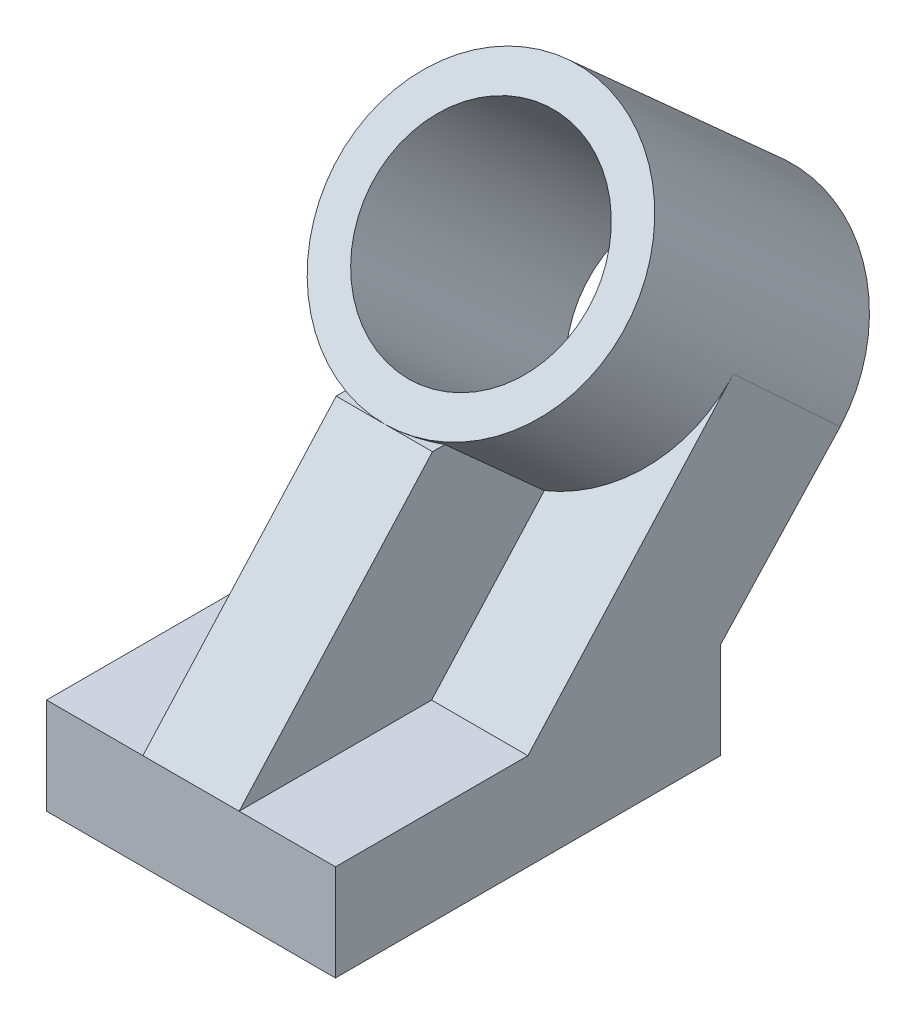
ISO-10303-21;
HEADER;
FILE_DESCRIPTION(('STEP AP214'),'2;1');
FILE_NAME('part.step','',(''),(''),'','','');
FILE_SCHEMA(('AUTOMOTIVE_DESIGN { 1 0 10303 214 1 1 1 1 }'));
ENDSEC;
DATA;
#1=APPLICATION_CONTEXT('core data for automotive mechanical design processes');
#2=APPLICATION_PROTOCOL_DEFINITION('international standard','automotive_design',2000,#1);
#3=PRODUCT_CONTEXT('',#1,'mechanical');
#4=PRODUCT('Part','Part','',(#3));
#5=PRODUCT_RELATED_PRODUCT_CATEGORY('part','',(#4));
#6=PRODUCT_DEFINITION_FORMATION('','',#4);
#7=PRODUCT_DEFINITION_CONTEXT('part definition',#1,'design');
#8=PRODUCT_DEFINITION('design','',#6,#7);
#9=PRODUCT_DEFINITION_SHAPE('','',#8);
#10=(LENGTH_UNIT() NAMED_UNIT(*) SI_UNIT(.MILLI.,.METRE.));
#11=(NAMED_UNIT(*) PLANE_ANGLE_UNIT() SI_UNIT($,.RADIAN.));
#12=(NAMED_UNIT(*) SI_UNIT($,.STERADIAN.) SOLID_ANGLE_UNIT());
#13=UNCERTAINTY_MEASURE_WITH_UNIT(LENGTH_MEASURE(1.E-05),#10,'distance_accuracy_value','');
#14=(GEOMETRIC_REPRESENTATION_CONTEXT(3) GLOBAL_UNCERTAINTY_ASSIGNED_CONTEXT((#13)) GLOBAL_UNIT_ASSIGNED_CONTEXT((#10,
#11,#12)) REPRESENTATION_CONTEXT('',''));
#15=CARTESIAN_POINT('',(0.,0.,0.));
#16=DIRECTION('',(0.,0.,1.));
#17=DIRECTION('',(1.,0.,0.));
#18=AXIS2_PLACEMENT_3D('',#15,#16,#17);
#19=CARTESIAN_POINT('',(0.,0.,0.));
#20=DIRECTION('',(0.,1.,0.));
#21=DIRECTION('',(0.,0.,1.));
#22=AXIS2_PLACEMENT_3D('',#19,#20,#21);
#23=PLANE('',#22);
#24=DIRECTION('',(1.,0.,0.));
#25=VECTOR('',#24,1.);
#26=CARTESIAN_POINT('',(-38.1000000000003,0.,0.));
#27=LINE('',#26,#25);
#28=CARTESIAN_POINT('',(-38.1000000000003,0.,0.));
#29=VERTEX_POINT('',#28);
#30=CARTESIAN_POINT('',(-12.7,0.,0.));
#31=VERTEX_POINT('',#30);
#32=EDGE_CURVE('E61',#29,#31,#27,.T.);
#33=ORIENTED_EDGE('',*,*,#32,.F.);
#34=DIRECTION('',(0.,0.,1.));
#35=VECTOR('',#34,1.);
#36=CARTESIAN_POINT('',(-38.1000000000003,0.,-50.8428477851647));
#37=LINE('',#36,#35);
#38=CARTESIAN_POINT('',(-38.1000000000003,0.,50.7571522148353));
#39=VERTEX_POINT('',#38);
#40=EDGE_CURVE('E269',#29,#39,#37,.T.);
#41=ORIENTED_EDGE('',*,*,#40,.T.);
#42=DIRECTION('',(1.,0.,0.));
#43=VECTOR('',#42,1.);
#44=CARTESIAN_POINT('',(-38.1000000000003,0.,50.7571522148353));
#45=LINE('',#44,#43);
#46=CARTESIAN_POINT('',(-12.7,0.,50.7571522148353));
#47=VERTEX_POINT('',#46);
#48=EDGE_CURVE('E272',#39,#47,#45,.T.);
#49=ORIENTED_EDGE('',*,*,#48,.T.);
#50=DIRECTION('',(0.,0.,-1.));
#51=VECTOR('',#50,1.);
#52=CARTESIAN_POINT('',(-12.7,0.,50.7571522148353));
#53=LINE('',#52,#51);
#54=EDGE_CURVE('E238',#47,#31,#53,.T.);
#55=ORIENTED_EDGE('',*,*,#54,.T.);
#56=EDGE_LOOP('',(#33,#41,#49,#55));
#57=FACE_BOUND('',#56,.T.);
#58=ADVANCED_FACE('F35',(#57),#23,.T.);
#59=CARTESIAN_POINT('',(0.,33.9537013475214,-82.3521117933596));
#60=DIRECTION('',(0.,0.669130606358857,0.743144825477395));
#61=DIRECTION('',(0.,-0.743144825477395,0.669130606358857));
#62=AXIS2_PLACEMENT_3D('',#59,#60,#61);
#63=CYLINDRICAL_SURFACE('',#62,38.1);
#64=CARTESIAN_POINT('',(0.,33.9537013475212,-82.3521117933597));
#65=DIRECTION('',(0.,0.732999845893333,-0.68022880409488));
#66=DIRECTION('',(0.,0.68022880409488,0.732999845893333));
#67=AXIS2_PLACEMENT_3D('',#64,#65,#66);
#68=ELLIPSE('',#67,2533.93804982842,38.1);
#69=CARTESIAN_POINT('',(38.0999999999997,33.9537013475214,-82.3521117933596));
#70=VERTEX_POINT('',#69);
#71=CARTESIAN_POINT('',(38.0956234491738,60.0787457357757,-54.2003290472178));
#72=VERTEX_POINT('',#71);
#73=EDGE_CURVE('E209',#70,#72,#68,.F.);
#74=ORIENTED_EDGE('',*,*,#73,.F.);
#75=CARTESIAN_POINT('',(0.,33.9537013475214,-82.3521117933596));
#76=DIRECTION('',(0.,0.669130606358857,0.743144825477395));
#77=DIRECTION('',(0.,-0.743144825477395,0.669130606358857));
#78=AXIS2_PLACEMENT_3D('',#75,#76,#77);
#79=CIRCLE('',#78,38.1);
#80=CARTESIAN_POINT('',(-38.1000000000003,33.9537013475214,-82.3521117933596));
#81=VERTEX_POINT('',#80);
#82=EDGE_CURVE('E212',#70,#81,#79,.T.);
#83=ORIENTED_EDGE('',*,*,#82,.T.);
#84=CARTESIAN_POINT('',(-38.0956234491738,60.0787457357757,-54.2003290472178));
#85=VERTEX_POINT('',#84);
#86=EDGE_CURVE('E178',#85,#81,#68,.F.);
#87=ORIENTED_EDGE('',*,*,#86,.F.);
#88=CARTESIAN_POINT('',(0.,59.6554109242284,-53.8074714849633));
#89=DIRECTION('',(0.,0.680228804094879,0.732999845893333));
#90=DIRECTION('',(0.,-0.732999845893333,0.680228804094879));
#91=AXIS2_PLACEMENT_3D('',#88,#89,#90);
#92=ELLIPSE('',#91,38.1043075129455,38.1);
#93=CARTESIAN_POINT('',(-38.1,59.6554109242284,-53.8074714849633));
#94=VERTEX_POINT('',#93);
#95=EDGE_CURVE('E159',#94,#85,#92,.F.);
#96=ORIENTED_EDGE('',*,*,#95,.F.);
#97=CARTESIAN_POINT('',(-37.8187786616942,56.2681260500793,-50.6640482605519));
#98=VERTEX_POINT('',#97);
#99=EDGE_CURVE('E45',#98,#94,#92,.F.);
#100=ORIENTED_EDGE('',*,*,#99,.F.);
#101=CARTESIAN_POINT('',(0.,59.7019039399693,-53.7558357598293));
#102=DIRECTION('',(0.,0.669130606358857,0.743144825477395));
#103=DIRECTION('',(0.,-0.743144825477395,0.669130606358857));
#104=AXIS2_PLACEMENT_3D('',#101,#102,#103);
#105=CIRCLE('',#104,38.1);
#106=CARTESIAN_POINT('',(-12.7,33.0073804686323,-29.719978865634));
#107=VERTEX_POINT('',#106);
#108=EDGE_CURVE('E44',#107,#98,#105,.F.);
#109=ORIENTED_EDGE('',*,*,#108,.F.);
#110=DIRECTION('',(0.,0.669130606358857,0.743144825477395));
#111=VECTOR('',#110,1.);
#112=CARTESIAN_POINT('',(-12.7,7.25917787618441,-58.3162548991642));
#113=LINE('',#112,#111);
#114=CARTESIAN_POINT('',(-12.7,56.6276357013775,-3.48702780068732));
#115=VERTEX_POINT('',#114);
#116=EDGE_CURVE('E278',#115,#107,#113,.F.);
#117=ORIENTED_EDGE('',*,*,#116,.F.);
#118=CARTESIAN_POINT('',(0.,56.6276357013775,-57.1701565395513));
#119=DIRECTION('',(0.,-1.,0.));
#120=DIRECTION('',(0.,0.,1.));
#121=AXIS2_PLACEMENT_3D('',#118,#119,#120);
#122=ELLIPSE('',#121,56.9395565498417,38.1);
#123=CARTESIAN_POINT('',(0.,56.6276357013775,-0.230599989709569));
#124=VERTEX_POINT('',#123);
#125=EDGE_CURVE('E215',#124,#115,#122,.T.);
#126=ORIENTED_EDGE('',*,*,#125,.F.);
#127=CARTESIAN_POINT('',(0.,84.9414535520663,-25.724476091982));
#128=DIRECTION('',(0.,0.669130606358857,0.743144825477395));
#129=DIRECTION('',(0.,-0.743144825477395,0.669130606358857));
#130=AXIS2_PLACEMENT_3D('',#127,#128,#129);
#131=CIRCLE('',#130,38.1);
#132=EDGE_CURVE('E217',#124,#124,#131,.T.);
#133=ORIENTED_EDGE('',*,*,#132,.F.);
#134=CARTESIAN_POINT('',(12.7,56.6276357013775,-3.48702780068732));
#135=VERTEX_POINT('',#134);
#136=EDGE_CURVE('E223',#135,#124,#122,.T.);
#137=ORIENTED_EDGE('',*,*,#136,.F.);
#138=DIRECTION('',(0.,0.669130606358857,0.743144825477395));
#139=VECTOR('',#138,1.);
#140=CARTESIAN_POINT('',(12.7,7.25917787618441,-58.3162548991642));
#141=LINE('',#140,#139);
#142=CARTESIAN_POINT('',(12.7,33.0073804686323,-29.719978865634));
#143=VERTEX_POINT('',#142);
#144=EDGE_CURVE('E222',#135,#143,#141,.F.);
#145=ORIENTED_EDGE('',*,*,#144,.T.);
#146=CARTESIAN_POINT('',(37.8187786616942,56.2681260500793,-50.6640482605519));
#147=VERTEX_POINT('',#146);
#148=EDGE_CURVE('E39',#147,#143,#105,.F.);
#149=ORIENTED_EDGE('',*,*,#148,.F.);
#150=CARTESIAN_POINT('',(38.0999999999998,59.6554109242284,-53.8074714849633));
#151=VERTEX_POINT('',#150);
#152=EDGE_CURVE('E46',#151,#147,#92,.F.);
#153=ORIENTED_EDGE('',*,*,#152,.F.);
#154=EDGE_CURVE('E11',#72,#151,#92,.F.);
#155=ORIENTED_EDGE('',*,*,#154,.F.);
#156=EDGE_LOOP('',(#74,#83,#87,#96,#100,#109,#117,#126,#133,#137,#145,#149,#153,#155));
#157=FACE_BOUND('',#156,.T.);
#158=ADVANCED_FACE('F316',(#157),#63,.T.);
#159=CARTESIAN_POINT('',(12.7,56.6276357013775,-0.230599989709555));
#160=DIRECTION('',(0.,-1.,0.));
#161=DIRECTION('',(0.,0.,-1.));
#162=AXIS2_PLACEMENT_3D('',#159,#160,#161);
#163=PLANE('',#162);
#164=DIRECTION('',(-1.,0.,0.));
#165=VECTOR('',#164,1.);
#166=CARTESIAN_POINT('',(12.7,56.6276357013775,-0.230599989709555));
#167=LINE('',#166,#165);
#168=CARTESIAN_POINT('',(-12.7,56.6276357013775,-0.230599989709555));
#169=VERTEX_POINT('',#168);
#170=EDGE_CURVE('E249',#124,#169,#167,.T.);
#171=ORIENTED_EDGE('',*,*,#170,.F.);
#172=ORIENTED_EDGE('',*,*,#125,.T.);
#173=DIRECTION('',(0.,0.,1.));
#174=VECTOR('',#173,1.);
#175=CARTESIAN_POINT('',(-12.7,56.6276357013775,-0.230599989709555));
#176=LINE('',#175,#174);
#177=EDGE_CURVE('E243',#115,#169,#176,.T.);
#178=ORIENTED_EDGE('',*,*,#177,.T.);
#179=EDGE_LOOP('',(#171,#172,#178));
#180=FACE_BOUND('',#179,.T.);
#181=ADVANCED_FACE('F322',(#180),#163,.F.);
#182=CARTESIAN_POINT('',(12.7,0.,0.));
#183=VERTEX_POINT('',#182);
#184=CARTESIAN_POINT('',(38.0999999999997,0.,0.));
#185=VERTEX_POINT('',#184);
#186=EDGE_CURVE('E203',#183,#185,#27,.T.);
#187=ORIENTED_EDGE('',*,*,#186,.F.);
#188=DIRECTION('',(0.,0.,-1.));
#189=VECTOR('',#188,1.);
#190=CARTESIAN_POINT('',(12.7,0.,50.7571522148353));
#191=LINE('',#190,#189);
#192=CARTESIAN_POINT('',(12.7,0.,50.7571522148353));
#193=VERTEX_POINT('',#192);
#194=EDGE_CURVE('E225',#193,#183,#191,.T.);
#195=ORIENTED_EDGE('',*,*,#194,.F.);
#196=CARTESIAN_POINT('',(38.0999999999997,0.,50.7571522148353));
#197=VERTEX_POINT('',#196);
#198=EDGE_CURVE('E271',#193,#197,#45,.T.);
#199=ORIENTED_EDGE('',*,*,#198,.T.);
#200=DIRECTION('',(0.,0.,-1.));
#201=VECTOR('',#200,1.);
#202=CARTESIAN_POINT('',(38.0999999999997,0.,50.7571522148353));
#203=LINE('',#202,#201);
#204=EDGE_CURVE('E53',#197,#185,#203,.T.);
#205=ORIENTED_EDGE('',*,*,#204,.T.);
#206=EDGE_LOOP('',(#187,#195,#199,#205));
#207=FACE_BOUND('',#206,.T.);
#208=ADVANCED_FACE('F318',(#207),#23,.T.);
#209=CARTESIAN_POINT('',(38.0999999999997,-25.4,-50.8428477851647));
#210=DIRECTION('',(0.,0.,-1.));
#211=DIRECTION('',(-1.,0.,0.));
#212=AXIS2_PLACEMENT_3D('',#209,#210,#211);
#213=PLANE('',#212);
#214=DIRECTION('',(-1.,0.,0.));
#215=VECTOR('',#214,1.);
#216=CARTESIAN_POINT('',(38.0999999999997,0.,-50.8428477851647));
#217=LINE('',#216,#215);
#218=CARTESIAN_POINT('',(38.0999999999997,0.,-50.8428477851647));
#219=VERTEX_POINT('',#218);
#220=CARTESIAN_POINT('',(-38.1000000000003,0.,-50.8428477851647));
#221=VERTEX_POINT('',#220);
#222=EDGE_CURVE('E253',#219,#221,#217,.T.);
#223=ORIENTED_EDGE('',*,*,#222,.F.);
#224=DIRECTION('',(0.,1.,0.));
#225=VECTOR('',#224,1.);
#226=CARTESIAN_POINT('',(38.0999999999997,-25.4,-50.8428477851647));
#227=LINE('',#226,#225);
#228=CARTESIAN_POINT('',(38.0999999999997,-25.4,-50.8428477851647));
#229=VERTEX_POINT('',#228);
#230=EDGE_CURVE('E276',#229,#219,#227,.T.);
#231=ORIENTED_EDGE('',*,*,#230,.F.);
#232=DIRECTION('',(-1.,0.,0.));
#233=VECTOR('',#232,1.);
#234=CARTESIAN_POINT('',(38.0999999999997,-25.4,-50.8428477851647));
#235=LINE('',#234,#233);
#236=CARTESIAN_POINT('',(-38.1000000000003,-25.4,-50.8428477851647));
#237=VERTEX_POINT('',#236);
#238=EDGE_CURVE('E254',#229,#237,#235,.T.);
#239=ORIENTED_EDGE('',*,*,#238,.T.);
#240=DIRECTION('',(0.,1.,0.));
#241=VECTOR('',#240,1.);
#242=CARTESIAN_POINT('',(-38.1000000000003,-25.4,-50.8428477851647));
#243=LINE('',#242,#241);
#244=EDGE_CURVE('E266',#237,#221,#243,.T.);
#245=ORIENTED_EDGE('',*,*,#244,.T.);
#246=EDGE_LOOP('',(#223,#231,#239,#245));
#247=FACE_BOUND('',#246,.T.);
#248=ADVANCED_FACE('F37',(#247),#213,.T.);
#249=CARTESIAN_POINT('',(38.0999999999997,-25.4,50.7571522148353));
#250=DIRECTION('',(1.,0.,0.));
#251=DIRECTION('',(0.,0.,-1.));
#252=AXIS2_PLACEMENT_3D('',#249,#250,#251);
#253=PLANE('',#252);
#254=ORIENTED_EDGE('',*,*,#204,.F.);
#255=DIRECTION('',(0.,1.,0.));
#256=VECTOR('',#255,1.);
#257=CARTESIAN_POINT('',(38.0999999999997,-25.4,50.7571522148353));
#258=LINE('',#257,#256);
#259=CARTESIAN_POINT('',(38.0999999999997,-25.4,50.7571522148353));
#260=VERTEX_POINT('',#259);
#261=EDGE_CURVE('E279',#260,#197,#258,.T.);
#262=ORIENTED_EDGE('',*,*,#261,.F.);
#263=DIRECTION('',(0.,0.,-1.));
#264=VECTOR('',#263,1.);
#265=CARTESIAN_POINT('',(38.0999999999997,-25.4,50.7571522148353));
#266=LINE('',#265,#264);
#267=EDGE_CURVE('E263',#260,#229,#266,.T.);
#268=ORIENTED_EDGE('',*,*,#267,.T.);
#269=ORIENTED_EDGE('',*,*,#230,.T.);
#270=DIRECTION('',(0.,0.732999845893333,-0.68022880409488));
#271=VECTOR('',#270,1.);
#272=CARTESIAN_POINT('',(38.0999999999997,33.9537013475214,-82.3521117933596));
#273=LINE('',#272,#271);
#274=EDGE_CURVE('E179',#219,#70,#273,.T.);
#275=ORIENTED_EDGE('',*,*,#274,.T.);
#276=DIRECTION('',(0.,0.68022880409488,0.732999845893333));
#277=VECTOR('',#276,1.);
#278=CARTESIAN_POINT('',(38.0999999999997,60.0787457357757,-54.2003290472178));
#279=LINE('',#278,#277);
#280=CARTESIAN_POINT('',(38.0999999999997,60.0787457357757,-54.2003290472178));
#281=VERTEX_POINT('',#280);
#282=EDGE_CURVE('E192',#70,#281,#279,.T.);
#283=ORIENTED_EDGE('',*,*,#282,.T.);
#284=DIRECTION('',(0.,-0.732999845893333,0.680228804094879));
#285=VECTOR('',#284,1.);
#286=CARTESIAN_POINT('',(38.0999999999997,56.2681260500793,-50.6640482605519));
#287=LINE('',#286,#285);
#288=EDGE_CURVE('E196',#281,#151,#287,.T.);
#289=ORIENTED_EDGE('',*,*,#288,.T.);
#290=CARTESIAN_POINT('',(38.0999999999997,56.2681260500793,-50.6640482605519));
#291=VERTEX_POINT('',#290);
#292=EDGE_CURVE('E195',#151,#291,#287,.T.);
#293=ORIENTED_EDGE('',*,*,#292,.T.);
#294=DIRECTION('',(0.,-0.743144825477395,0.669130606358857));
#295=VECTOR('',#294,1.);
#296=CARTESIAN_POINT('',(38.0999999999997,0.,0.));
#297=LINE('',#296,#295);
#298=EDGE_CURVE('E182',#291,#185,#297,.T.);
#299=ORIENTED_EDGE('',*,*,#298,.T.);
#300=EDGE_LOOP('',(#254,#262,#268,#269,#275,#283,#289,#293,#299));
#301=FACE_BOUND('',#300,.T.);
#302=ADVANCED_FACE('F332',(#301),#253,.T.);
#303=CARTESIAN_POINT('',(-38.1000000000003,-25.4,50.7571522148353));
#304=DIRECTION('',(0.,0.,1.));
#305=DIRECTION('',(1.,0.,0.));
#306=AXIS2_PLACEMENT_3D('',#303,#304,#305);
#307=PLANE('',#306);
#308=ORIENTED_EDGE('',*,*,#48,.F.);
#309=DIRECTION('',(0.,1.,0.));
#310=VECTOR('',#309,1.);
#311=CARTESIAN_POINT('',(-38.1000000000003,-25.4,50.7571522148353));
#312=LINE('',#311,#310);
#313=CARTESIAN_POINT('',(-38.1000000000003,-25.4,50.7571522148353));
#314=VERTEX_POINT('',#313);
#315=EDGE_CURVE('E282',#314,#39,#312,.T.);
#316=ORIENTED_EDGE('',*,*,#315,.F.);
#317=DIRECTION('',(1.,0.,0.));
#318=VECTOR('',#317,1.);
#319=CARTESIAN_POINT('',(-38.1000000000003,-25.4,50.7571522148353));
#320=LINE('',#319,#318);
#321=EDGE_CURVE('E260',#314,#260,#320,.T.);
#322=ORIENTED_EDGE('',*,*,#321,.T.);
#323=ORIENTED_EDGE('',*,*,#261,.T.);
#324=ORIENTED_EDGE('',*,*,#198,.F.);
#325=DIRECTION('',(-1.,0.,0.));
#326=VECTOR('',#325,1.);
#327=CARTESIAN_POINT('',(12.7,0.,50.7571522148353));
#328=LINE('',#327,#326);
#329=EDGE_CURVE('E237',#193,#47,#328,.T.);
#330=ORIENTED_EDGE('',*,*,#329,.T.);
#331=EDGE_LOOP('',(#308,#316,#322,#323,#324,#330));
#332=FACE_BOUND('',#331,.T.);
#333=ADVANCED_FACE('F358',(#332),#307,.T.);
#334=CARTESIAN_POINT('',(-38.1000000000003,-25.4,-50.8428477851647));
#335=DIRECTION('',(-1.,0.,0.));
#336=DIRECTION('',(0.,0.,1.));
#337=AXIS2_PLACEMENT_3D('',#334,#335,#336);
#338=PLANE('',#337);
#339=ORIENTED_EDGE('',*,*,#40,.F.);
#340=DIRECTION('',(0.,-0.743144825477395,0.669130606358857));
#341=VECTOR('',#340,1.);
#342=CARTESIAN_POINT('',(-38.1000000000003,0.,0.));
#343=LINE('',#342,#341);
#344=CARTESIAN_POINT('',(-38.1000000000003,56.2681260500793,-50.6640482605519));
#345=VERTEX_POINT('',#344);
#346=EDGE_CURVE('E175',#345,#29,#343,.T.);
#347=ORIENTED_EDGE('',*,*,#346,.F.);
#348=DIRECTION('',(0.,-0.732999845893333,0.680228804094879));
#349=VECTOR('',#348,1.);
#350=CARTESIAN_POINT('',(-38.1000000000003,56.2681260500793,-50.6640482605519));
#351=LINE('',#350,#349);
#352=EDGE_CURVE('E174',#94,#345,#351,.T.);
#353=ORIENTED_EDGE('',*,*,#352,.F.);
#354=CARTESIAN_POINT('',(-38.1000000000003,60.0787457357757,-54.2003290472178));
#355=VERTEX_POINT('',#354);
#356=EDGE_CURVE('E158',#355,#94,#351,.T.);
#357=ORIENTED_EDGE('',*,*,#356,.F.);
#358=DIRECTION('',(0.,0.68022880409488,0.732999845893333));
#359=VECTOR('',#358,1.);
#360=CARTESIAN_POINT('',(-38.1000000000003,60.0787457357757,-54.2003290472178));
#361=LINE('',#360,#359);
#362=EDGE_CURVE('E171',#81,#355,#361,.T.);
#363=ORIENTED_EDGE('',*,*,#362,.F.);
#364=DIRECTION('',(0.,0.732999845893333,-0.68022880409488));
#365=VECTOR('',#364,1.);
#366=CARTESIAN_POINT('',(-38.1000000000003,33.9537013475214,-82.3521117933596));
#367=LINE('',#366,#365);
#368=EDGE_CURVE('E190',#221,#81,#367,.T.);
#369=ORIENTED_EDGE('',*,*,#368,.F.);
#370=ORIENTED_EDGE('',*,*,#244,.F.);
#371=DIRECTION('',(0.,0.,1.));
#372=VECTOR('',#371,1.);
#373=CARTESIAN_POINT('',(-38.1000000000003,-25.4,-50.8428477851647));
#374=LINE('',#373,#372);
#375=EDGE_CURVE('E257',#237,#314,#374,.T.);
#376=ORIENTED_EDGE('',*,*,#375,.T.);
#377=ORIENTED_EDGE('',*,*,#315,.T.);
#378=EDGE_LOOP('',(#339,#347,#353,#357,#363,#369,#370,#376,#377));
#379=FACE_BOUND('',#378,.T.);
#380=ADVANCED_FACE('F169',(#379),#338,.T.);
#381=CARTESIAN_POINT('',(0.,-25.4,0.));
#382=DIRECTION('',(0.,1.,0.));
#383=DIRECTION('',(0.,0.,1.));
#384=AXIS2_PLACEMENT_3D('',#381,#382,#383);
#385=PLANE('',#384);
#386=ORIENTED_EDGE('',*,*,#238,.F.);
#387=ORIENTED_EDGE('',*,*,#267,.F.);
#388=ORIENTED_EDGE('',*,*,#321,.F.);
#389=ORIENTED_EDGE('',*,*,#375,.F.);
#390=EDGE_LOOP('',(#386,#387,#388,#389));
#391=FACE_BOUND('',#390,.T.);
#392=ADVANCED_FACE('F364',(#391),#385,.F.);
#393=DIRECTION('',(0.,0.,1.));
#394=VECTOR('',#393,1.);
#395=CARTESIAN_POINT('',(12.7,56.6276357013775,-0.230599989709555));
#396=LINE('',#395,#394);
#397=CARTESIAN_POINT('',(12.7,56.6276357013775,-0.230599989709555));
#398=VERTEX_POINT('',#397);
#399=EDGE_CURVE('E232',#135,#398,#396,.T.);
#400=ORIENTED_EDGE('',*,*,#399,.F.);
#401=ORIENTED_EDGE('',*,*,#136,.T.);
#402=EDGE_CURVE('E250',#398,#124,#167,.T.);
#403=ORIENTED_EDGE('',*,*,#402,.F.);
#404=EDGE_LOOP('',(#400,#401,#403));
#405=FACE_BOUND('',#404,.T.);
#406=ADVANCED_FACE('F336',(#405),#163,.F.);
#407=CARTESIAN_POINT('',(12.7,0.,50.7571522148353));
#408=DIRECTION('',(0.,-0.669130606358857,-0.743144825477395));
#409=DIRECTION('',(0.,0.743144825477395,-0.669130606358857));
#410=AXIS2_PLACEMENT_3D('',#407,#408,#409);
#411=PLANE('',#410);
#412=DIRECTION('',(0.,-0.743144825477395,0.669130606358857));
#413=VECTOR('',#412,1.);
#414=CARTESIAN_POINT('',(-12.7,0.,50.7571522148353));
#415=LINE('',#414,#413);
#416=EDGE_CURVE('E229',#169,#47,#415,.T.);
#417=ORIENTED_EDGE('',*,*,#416,.T.);
#418=ORIENTED_EDGE('',*,*,#329,.F.);
#419=DIRECTION('',(0.,-0.743144825477395,0.669130606358857));
#420=VECTOR('',#419,1.);
#421=CARTESIAN_POINT('',(12.7,0.,50.7571522148353));
#422=LINE('',#421,#420);
#423=EDGE_CURVE('E234',#398,#193,#422,.T.);
#424=ORIENTED_EDGE('',*,*,#423,.F.);
#425=ORIENTED_EDGE('',*,*,#402,.T.);
#426=ORIENTED_EDGE('',*,*,#170,.T.);
#427=EDGE_LOOP('',(#417,#418,#424,#425,#426));
#428=FACE_BOUND('',#427,.T.);
#429=ADVANCED_FACE('F353',(#428),#411,.F.);
#430=CARTESIAN_POINT('',(12.7,0.,0.));
#431=DIRECTION('',(1.,0.,0.));
#432=DIRECTION('',(0.,0.,-1.));
#433=AXIS2_PLACEMENT_3D('',#430,#431,#432);
#434=PLANE('',#433);
#435=ORIENTED_EDGE('',*,*,#144,.F.);
#436=ORIENTED_EDGE('',*,*,#399,.T.);
#437=ORIENTED_EDGE('',*,*,#423,.T.);
#438=ORIENTED_EDGE('',*,*,#194,.T.);
#439=DIRECTION('',(0.,0.743144825477395,-0.669130606358857));
#440=VECTOR('',#439,1.);
#441=CARTESIAN_POINT('',(12.7,0.,0.));
#442=LINE('',#441,#440);
#443=EDGE_CURVE('E228',#183,#143,#442,.T.);
#444=ORIENTED_EDGE('',*,*,#443,.T.);
#445=EDGE_LOOP('',(#435,#436,#437,#438,#444));
#446=FACE_BOUND('',#445,.T.);
#447=ADVANCED_FACE('F343',(#446),#434,.T.);
#448=CARTESIAN_POINT('',(-12.7,0.,0.));
#449=DIRECTION('',(1.,0.,0.));
#450=DIRECTION('',(0.,0.,-1.));
#451=AXIS2_PLACEMENT_3D('',#448,#449,#450);
#452=PLANE('',#451);
#453=ORIENTED_EDGE('',*,*,#177,.F.);
#454=ORIENTED_EDGE('',*,*,#116,.T.);
#455=DIRECTION('',(0.,0.743144825477395,-0.669130606358857));
#456=VECTOR('',#455,1.);
#457=CARTESIAN_POINT('',(-12.7,0.,0.));
#458=LINE('',#457,#456);
#459=EDGE_CURVE('E240',#31,#107,#458,.T.);
#460=ORIENTED_EDGE('',*,*,#459,.F.);
#461=ORIENTED_EDGE('',*,*,#54,.F.);
#462=ORIENTED_EDGE('',*,*,#416,.F.);
#463=EDGE_LOOP('',(#453,#454,#460,#461,#462));
#464=FACE_BOUND('',#463,.T.);
#465=ADVANCED_FACE('F392',(#464),#452,.F.);
#466=CARTESIAN_POINT('',(0.,33.9537013475214,-82.3521117933596));
#467=DIRECTION('',(0.,-0.68022880409488,-0.732999845893333));
#468=DIRECTION('',(0.,-0.732999845893333,0.68022880409488));
#469=AXIS2_PLACEMENT_3D('',#466,#467,#468);
#470=ELLIPSE('',#469,38.1043075129455,38.1);
#471=EDGE_CURVE('E202',#81,#70,#470,.F.);
#472=ORIENTED_EDGE('',*,*,#471,.F.);
#473=EDGE_CURVE('E216',#81,#70,#79,.T.);
#474=ORIENTED_EDGE('',*,*,#473,.T.);
#475=EDGE_LOOP('',(#472,#474));
#476=FACE_BOUND('',#475,.T.);
#477=ADVANCED_FACE('F324',(#476),#63,.T.);
#478=CARTESIAN_POINT('',(0.,33.9537013475214,-82.3521117933596));
#479=DIRECTION('',(0.,0.669130606358857,0.743144825477395));
#480=DIRECTION('',(0.,-0.743144825477395,0.669130606358857));
#481=AXIS2_PLACEMENT_3D('',#478,#479,#480);
#482=PLANE('',#481);
#483=CARTESIAN_POINT('',(0.,33.9537013475214,-82.3521117933596));
#484=DIRECTION('',(0.,0.669130606358857,0.743144825477395));
#485=DIRECTION('',(0.,-0.743144825477395,0.669130606358857));
#486=AXIS2_PLACEMENT_3D('',#483,#484,#485);
#487=CIRCLE('',#486,28.575);
#488=CARTESIAN_POINT('',(0.,12.7183379595048,-63.2317047166552));
#489=VERTEX_POINT('',#488);
#490=EDGE_CURVE('E185',#489,#489,#487,.T.);
#491=ORIENTED_EDGE('',*,*,#490,.T.);
#492=EDGE_LOOP('',(#491));
#493=FACE_BOUND('',#492,.T.);
#494=ORIENTED_EDGE('',*,*,#473,.F.);
#495=ORIENTED_EDGE('',*,*,#82,.F.);
#496=EDGE_LOOP('',(#494,#495));
#497=FACE_BOUND('',#496,.T.);
#498=ADVANCED_FACE('F382',(#493,#497),#482,.F.);
#499=CARTESIAN_POINT('',(0.,84.9414535520663,-25.724476091982));
#500=DIRECTION('',(0.,0.669130606358857,0.743144825477395));
#501=DIRECTION('',(0.,-0.743144825477395,0.669130606358857));
#502=AXIS2_PLACEMENT_3D('',#499,#500,#501);
#503=PLANE('',#502);
#504=CARTESIAN_POINT('',(0.,84.9414535520663,-25.724476091982));
#505=DIRECTION('',(0.,0.669130606358857,0.743144825477395));
#506=DIRECTION('',(0.,-0.743144825477395,0.669130606358857));
#507=AXIS2_PLACEMENT_3D('',#504,#505,#506);
#508=CIRCLE('',#507,28.575);
#509=CARTESIAN_POINT('',(0.,63.7060901640498,-6.60406901527769));
#510=VERTEX_POINT('',#509);
#511=EDGE_CURVE('E571',#510,#510,#508,.T.);
#512=ORIENTED_EDGE('',*,*,#511,.F.);
#513=EDGE_LOOP('',(#512));
#514=FACE_BOUND('',#513,.T.);
#515=ORIENTED_EDGE('',*,*,#132,.T.);
#516=EDGE_LOOP('',(#515));
#517=FACE_BOUND('',#516,.T.);
#518=ADVANCED_FACE('F309',(#514,#517),#503,.T.);
#519=CARTESIAN_POINT('',(-38.1000000000003,0.,0.));
#520=DIRECTION('',(0.,0.669130606358857,0.743144825477395));
#521=DIRECTION('',(0.,-0.743144825477395,0.669130606358857));
#522=AXIS2_PLACEMENT_3D('',#519,#520,#521);
#523=PLANE('',#522);
#524=ORIENTED_EDGE('',*,*,#459,.T.);
#525=ORIENTED_EDGE('',*,*,#108,.T.);
#526=DIRECTION('',(1.,0.,0.));
#527=VECTOR('',#526,1.);
#528=CARTESIAN_POINT('',(-38.1000000000003,56.2681260500793,-50.6640482605519));
#529=LINE('',#528,#527);
#530=EDGE_CURVE('E204',#345,#98,#529,.T.);
#531=ORIENTED_EDGE('',*,*,#530,.F.);
#532=ORIENTED_EDGE('',*,*,#346,.T.);
#533=ORIENTED_EDGE('',*,*,#32,.T.);
#534=EDGE_LOOP('',(#524,#525,#531,#532,#533));
#535=FACE_BOUND('',#534,.T.);
#536=ADVANCED_FACE('F297',(#535),#523,.T.);
#537=CARTESIAN_POINT('',(-38.1000000000003,56.2681260500793,-50.6640482605519));
#538=DIRECTION('',(0.,0.680228804094879,0.732999845893333));
#539=DIRECTION('',(0.,-0.732999845893333,0.680228804094879));
#540=AXIS2_PLACEMENT_3D('',#537,#538,#539);
#541=PLANE('',#540);
#542=ORIENTED_EDGE('',*,*,#530,.T.);
#543=ORIENTED_EDGE('',*,*,#99,.T.);
#544=ORIENTED_EDGE('',*,*,#352,.T.);
#545=EDGE_LOOP('',(#542,#543,#544));
#546=FACE_BOUND('',#545,.T.);
#547=ADVANCED_FACE('F300',(#546),#541,.T.);
#548=ORIENTED_EDGE('',*,*,#356,.T.);
#549=ORIENTED_EDGE('',*,*,#95,.T.);
#550=DIRECTION('',(1.,0.,0.));
#551=VECTOR('',#550,1.);
#552=CARTESIAN_POINT('',(-38.1000000000003,60.0787457357757,-54.2003290472178));
#553=LINE('',#552,#551);
#554=EDGE_CURVE('E155',#355,#85,#553,.T.);
#555=ORIENTED_EDGE('',*,*,#554,.F.);
#556=EDGE_LOOP('',(#548,#549,#555));
#557=FACE_BOUND('',#556,.T.);
#558=ADVANCED_FACE('F157',(#557),#541,.T.);
#559=EDGE_CURVE('E164',#72,#281,#553,.T.);
#560=ORIENTED_EDGE('',*,*,#559,.F.);
#561=ORIENTED_EDGE('',*,*,#154,.T.);
#562=ORIENTED_EDGE('',*,*,#288,.F.);
#563=EDGE_LOOP('',(#560,#561,#562));
#564=FACE_BOUND('',#563,.T.);
#565=ADVANCED_FACE('F308',(#564),#541,.T.);
#566=CARTESIAN_POINT('',(-38.1000000000003,60.0787457357757,-54.2003290472178));
#567=DIRECTION('',(0.,0.732999845893333,-0.68022880409488));
#568=DIRECTION('',(0.,0.68022880409488,0.732999845893333));
#569=AXIS2_PLACEMENT_3D('',#566,#567,#568);
#570=PLANE('',#569);
#571=ORIENTED_EDGE('',*,*,#554,.T.);
#572=ORIENTED_EDGE('',*,*,#86,.T.);
#573=ORIENTED_EDGE('',*,*,#362,.T.);
#574=EDGE_LOOP('',(#571,#572,#573));
#575=FACE_BOUND('',#574,.T.);
#576=ADVANCED_FACE('F177',(#575),#570,.T.);
#577=ORIENTED_EDGE('',*,*,#282,.F.);
#578=ORIENTED_EDGE('',*,*,#73,.T.);
#579=ORIENTED_EDGE('',*,*,#559,.T.);
#580=EDGE_LOOP('',(#577,#578,#579));
#581=FACE_BOUND('',#580,.T.);
#582=ADVANCED_FACE('F374',(#581),#570,.T.);
#583=CARTESIAN_POINT('',(-38.1000000000003,33.9537013475214,-82.3521117933596));
#584=DIRECTION('',(0.,-0.68022880409488,-0.732999845893333));
#585=DIRECTION('',(0.,0.732999845893333,-0.68022880409488));
#586=AXIS2_PLACEMENT_3D('',#583,#584,#585);
#587=PLANE('',#586);
#588=ORIENTED_EDGE('',*,*,#368,.T.);
#589=ORIENTED_EDGE('',*,*,#471,.T.);
#590=ORIENTED_EDGE('',*,*,#274,.F.);
#591=ORIENTED_EDGE('',*,*,#222,.T.);
#592=EDGE_LOOP('',(#588,#589,#590,#591));
#593=FACE_BOUND('',#592,.T.);
#594=ADVANCED_FACE('F377',(#593),#587,.T.);
#595=ORIENTED_EDGE('',*,*,#148,.T.);
#596=ORIENTED_EDGE('',*,*,#443,.F.);
#597=ORIENTED_EDGE('',*,*,#186,.T.);
#598=ORIENTED_EDGE('',*,*,#298,.F.);
#599=EDGE_CURVE('E163',#147,#291,#529,.T.);
#600=ORIENTED_EDGE('',*,*,#599,.F.);
#601=EDGE_LOOP('',(#595,#596,#597,#598,#600));
#602=FACE_BOUND('',#601,.T.);
#603=ADVANCED_FACE('F311',(#602),#523,.T.);
#604=ORIENTED_EDGE('',*,*,#292,.F.);
#605=ORIENTED_EDGE('',*,*,#152,.T.);
#606=ORIENTED_EDGE('',*,*,#599,.T.);
#607=EDGE_LOOP('',(#604,#605,#606));
#608=FACE_BOUND('',#607,.T.);
#609=ADVANCED_FACE('F303',(#608),#541,.T.);
#610=CARTESIAN_POINT('',(0.,-5.29818272144536,-125.945745470979));
#611=DIRECTION('',(0.,0.669130606358857,0.743144825477395));
#612=DIRECTION('',(0.,-0.743144825477395,0.669130606358857));
#613=AXIS2_PLACEMENT_3D('',#610,#611,#612);
#614=CYLINDRICAL_SURFACE('',#613,28.575);
#615=ORIENTED_EDGE('',*,*,#511,.T.);
#616=EDGE_LOOP('',(#615));
#617=FACE_BOUND('',#616,.T.);
#618=ORIENTED_EDGE('',*,*,#490,.F.);
#619=EDGE_LOOP('',(#618));
#620=FACE_BOUND('',#619,.T.);
#621=ADVANCED_FACE('F314',(#617,#620),#614,.F.);
#622=CLOSED_SHELL('',(#58,#158,#181,#208,#248,#302,#333,#380,#392,#406,#429,#447,#465,#477,#498,
#518,#536,#547,#558,#565,#576,#582,#594,#603,#609,#621));
#623=MANIFOLD_SOLID_BREP('B2',#622);
#624=ADVANCED_BREP_SHAPE_REPRESENTATION('',(#18,#623),#14);
#625=SHAPE_DEFINITION_REPRESENTATION(#9,#624);
ENDSEC;
END-ISO-10303-21;
